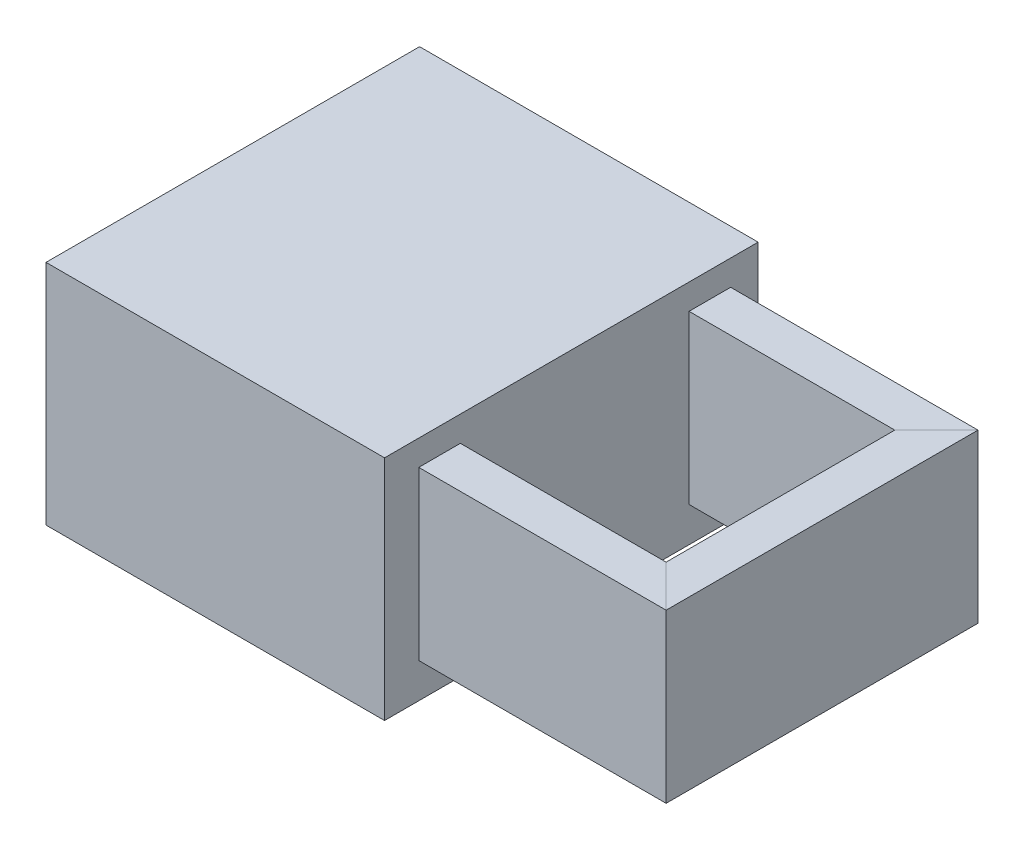
ISO-10303-21;
HEADER;
FILE_DESCRIPTION(('STEP AP214'),'2;1');
FILE_NAME('part.step','',(''),(''),'','','');
FILE_SCHEMA(('AUTOMOTIVE_DESIGN { 1 0 10303 214 1 1 1 1 }'));
ENDSEC;
DATA;
#1=APPLICATION_CONTEXT('core data for automotive mechanical design processes');
#2=APPLICATION_PROTOCOL_DEFINITION('international standard','automotive_design',2000,#1);
#3=PRODUCT_CONTEXT('',#1,'mechanical');
#4=PRODUCT('Part','Part','',(#3));
#5=PRODUCT_RELATED_PRODUCT_CATEGORY('part','',(#4));
#6=PRODUCT_DEFINITION_FORMATION('','',#4);
#7=PRODUCT_DEFINITION_CONTEXT('part definition',#1,'design');
#8=PRODUCT_DEFINITION('design','',#6,#7);
#9=PRODUCT_DEFINITION_SHAPE('','',#8);
#10=(LENGTH_UNIT() NAMED_UNIT(*) SI_UNIT(.MILLI.,.METRE.));
#11=(NAMED_UNIT(*) PLANE_ANGLE_UNIT() SI_UNIT($,.RADIAN.));
#12=(NAMED_UNIT(*) SI_UNIT($,.STERADIAN.) SOLID_ANGLE_UNIT());
#13=UNCERTAINTY_MEASURE_WITH_UNIT(LENGTH_MEASURE(1.E-05),#10,'distance_accuracy_value','');
#14=(GEOMETRIC_REPRESENTATION_CONTEXT(3) GLOBAL_UNCERTAINTY_ASSIGNED_CONTEXT((#13)) GLOBAL_UNIT_ASSIGNED_CONTEXT((#10,
#11,#12)) REPRESENTATION_CONTEXT('',''));
#15=CARTESIAN_POINT('',(0.,0.,0.));
#16=DIRECTION('',(0.,0.,1.));
#17=DIRECTION('',(1.,0.,0.));
#18=AXIS2_PLACEMENT_3D('',#15,#16,#17);
#19=CARTESIAN_POINT('',(35.0671663784504,-3.97466672374522,90.));
#20=DIRECTION('',(1.,0.,0.));
#21=DIRECTION('',(0.,0.,-1.));
#22=AXIS2_PLACEMENT_3D('',#19,#20,#21);
#23=PLANE('',#22);
#24=DIRECTION('',(0.,-1.,0.));
#25=VECTOR('',#24,1.);
#26=CARTESIAN_POINT('',(35.0671663784504,-10.0879019275339,81.7561807456855));
#27=LINE('',#26,#25);
#28=CARTESIAN_POINT('',(35.0671663784504,-10.0879019275339,81.7561807456855));
#29=VERTEX_POINT('',#28);
#30=CARTESIAN_POINT('',(35.0671663784504,-50.3889408943223,81.7561807456855));
#31=VERTEX_POINT('',#30);
#32=EDGE_CURVE('E58',#29,#31,#27,.T.);
#33=ORIENTED_EDGE('',*,*,#32,.F.);
#34=DIRECTION('',(0.,0.,1.));
#35=VECTOR('',#34,1.);
#36=CARTESIAN_POINT('',(35.0671663784504,-10.0879019275339,81.7561807456855));
#37=LINE('',#36,#35);
#38=CARTESIAN_POINT('',(35.0671663784504,-10.0879019275339,71.7363874347257));
#39=VERTEX_POINT('',#38);
#40=EDGE_CURVE('E126',#39,#29,#37,.T.);
#41=ORIENTED_EDGE('',*,*,#40,.F.);
#42=DIRECTION('',(0.,1.,0.));
#43=VECTOR('',#42,1.);
#44=CARTESIAN_POINT('',(35.0671663784504,-10.0879019275339,71.7363874347257));
#45=LINE('',#44,#43);
#46=CARTESIAN_POINT('',(35.0671663784504,-50.3889408943223,71.7363874347257));
#47=VERTEX_POINT('',#46);
#48=EDGE_CURVE('E122',#47,#39,#45,.T.);
#49=ORIENTED_EDGE('',*,*,#48,.F.);
#50=DIRECTION('',(0.,0.,-1.));
#51=VECTOR('',#50,1.);
#52=CARTESIAN_POINT('',(35.0671663784504,-50.3889408943223,81.7561807456855));
#53=LINE('',#52,#51);
#54=EDGE_CURVE('E125',#31,#47,#53,.T.);
#55=ORIENTED_EDGE('',*,*,#54,.F.);
#56=EDGE_LOOP('',(#33,#41,#49,#55));
#57=FACE_BOUND('',#56,.T.);
#58=DIRECTION('',(0.,-1.,0.));
#59=VECTOR('',#58,1.);
#60=CARTESIAN_POINT('',(35.0671663784504,-3.97466672374522,0.));
#61=LINE('',#60,#59);
#62=CARTESIAN_POINT('',(35.0671663784504,-3.97466672374522,0.));
#63=VERTEX_POINT('',#62);
#64=CARTESIAN_POINT('',(35.0671663784504,-58.7915357410409,0.));
#65=VERTEX_POINT('',#64);
#66=EDGE_CURVE('E222',#63,#65,#61,.T.);
#67=ORIENTED_EDGE('',*,*,#66,.F.);
#68=DIRECTION('',(0.,0.,-1.));
#69=VECTOR('',#68,1.);
#70=CARTESIAN_POINT('',(35.0671663784504,-3.97466672374522,90.));
#71=LINE('',#70,#69);
#72=CARTESIAN_POINT('',(35.0671663784504,-3.97466672374522,90.));
#73=VERTEX_POINT('',#72);
#74=EDGE_CURVE('E228',#73,#63,#71,.T.);
#75=ORIENTED_EDGE('',*,*,#74,.F.);
#76=DIRECTION('',(0.,-1.,0.));
#77=VECTOR('',#76,1.);
#78=CARTESIAN_POINT('',(35.0671663784504,-3.97466672374522,90.));
#79=LINE('',#78,#77);
#80=CARTESIAN_POINT('',(35.0671663784504,-58.7915357410409,90.));
#81=VERTEX_POINT('',#80);
#82=EDGE_CURVE('E208',#73,#81,#79,.T.);
#83=ORIENTED_EDGE('',*,*,#82,.T.);
#84=DIRECTION('',(0.,0.,-1.));
#85=VECTOR('',#84,1.);
#86=CARTESIAN_POINT('',(35.0671663784504,-58.7915357410409,90.));
#87=LINE('',#86,#85);
#88=EDGE_CURVE('E43',#81,#65,#87,.T.);
#89=ORIENTED_EDGE('',*,*,#88,.T.);
#90=EDGE_LOOP('',(#67,#75,#83,#89));
#91=FACE_BOUND('',#90,.T.);
#92=DIRECTION('',(0.,0.,-1.));
#93=VECTOR('',#92,1.);
#94=CARTESIAN_POINT('',(35.0671663784504,-10.0879019275339,6.622180574567));
#95=LINE('',#94,#93);
#96=CARTESIAN_POINT('',(35.0671663784504,-10.0879019275339,16.6419738855268));
#97=VERTEX_POINT('',#96);
#98=CARTESIAN_POINT('',(35.0671663784504,-10.0879019275339,6.622180574567));
#99=VERTEX_POINT('',#98);
#100=EDGE_CURVE('E180',#97,#99,#95,.T.);
#101=ORIENTED_EDGE('',*,*,#100,.T.);
#102=DIRECTION('',(0.,-1.,0.));
#103=VECTOR('',#102,1.);
#104=CARTESIAN_POINT('',(35.0671663784504,-10.0879019275339,6.622180574567));
#105=LINE('',#104,#103);
#106=CARTESIAN_POINT('',(35.0671663784504,-50.3889408943223,6.622180574567));
#107=VERTEX_POINT('',#106);
#108=EDGE_CURVE('E189',#99,#107,#105,.T.);
#109=ORIENTED_EDGE('',*,*,#108,.T.);
#110=DIRECTION('',(0.,0.,1.));
#111=VECTOR('',#110,1.);
#112=CARTESIAN_POINT('',(35.0671663784504,-50.3889408943223,6.622180574567));
#113=LINE('',#112,#111);
#114=CARTESIAN_POINT('',(35.0671663784504,-50.3889408943223,16.6419738855268));
#115=VERTEX_POINT('',#114);
#116=EDGE_CURVE('E186',#107,#115,#113,.T.);
#117=ORIENTED_EDGE('',*,*,#116,.T.);
#118=DIRECTION('',(0.,1.,0.));
#119=VECTOR('',#118,1.);
#120=CARTESIAN_POINT('',(35.0671663784504,-10.0879019275339,16.6419738855268));
#121=LINE('',#120,#119);
#122=EDGE_CURVE('E183',#115,#97,#121,.T.);
#123=ORIENTED_EDGE('',*,*,#122,.T.);
#124=EDGE_LOOP('',(#101,#109,#117,#123));
#125=FACE_BOUND('',#124,.T.);
#126=ADVANCED_FACE('F35',(#57,#91,#125),#23,.T.);
#127=CARTESIAN_POINT('',(-46.4942650313667,-3.97466672374522,90.));
#128=DIRECTION('',(1.,0.,0.));
#129=DIRECTION('',(0.,0.,-1.));
#130=AXIS2_PLACEMENT_3D('',#127,#128,#129);
#131=PLANE('',#130);
#132=DIRECTION('',(0.,-1.,0.));
#133=VECTOR('',#132,1.);
#134=CARTESIAN_POINT('',(-46.4942650313667,-3.97466672374522,0.));
#135=LINE('',#134,#133);
#136=CARTESIAN_POINT('',(-46.4942650313667,-3.97466672374522,0.));
#137=VERTEX_POINT('',#136);
#138=CARTESIAN_POINT('',(-46.4942650313667,-58.7915357410409,0.));
#139=VERTEX_POINT('',#138);
#140=EDGE_CURVE('E215',#137,#139,#135,.T.);
#141=ORIENTED_EDGE('',*,*,#140,.T.);
#142=DIRECTION('',(0.,0.,-1.));
#143=VECTOR('',#142,1.);
#144=CARTESIAN_POINT('',(-46.4942650313667,-58.7915357410409,90.));
#145=LINE('',#144,#143);
#146=CARTESIAN_POINT('',(-46.4942650313667,-58.7915357410409,90.));
#147=VERTEX_POINT('',#146);
#148=EDGE_CURVE('E11',#147,#139,#145,.T.);
#149=ORIENTED_EDGE('',*,*,#148,.F.);
#150=DIRECTION('',(0.,-1.,0.));
#151=VECTOR('',#150,1.);
#152=CARTESIAN_POINT('',(-46.4942650313667,-3.97466672374522,90.));
#153=LINE('',#152,#151);
#154=CARTESIAN_POINT('',(-46.4942650313667,-3.97466672374522,90.));
#155=VERTEX_POINT('',#154);
#156=EDGE_CURVE('E202',#155,#147,#153,.T.);
#157=ORIENTED_EDGE('',*,*,#156,.F.);
#158=DIRECTION('',(0.,0.,-1.));
#159=VECTOR('',#158,1.);
#160=CARTESIAN_POINT('',(-46.4942650313667,-3.97466672374522,90.));
#161=LINE('',#160,#159);
#162=EDGE_CURVE('E214',#155,#137,#161,.T.);
#163=ORIENTED_EDGE('',*,*,#162,.T.);
#164=EDGE_LOOP('',(#141,#149,#157,#163));
#165=FACE_BOUND('',#164,.T.);
#166=ADVANCED_FACE('F37',(#165),#131,.F.);
#167=CARTESIAN_POINT('',(-46.4942650313667,-58.7915357410409,90.));
#168=DIRECTION('',(0.,1.,0.));
#169=DIRECTION('',(0.,0.,1.));
#170=AXIS2_PLACEMENT_3D('',#167,#168,#169);
#171=PLANE('',#170);
#172=DIRECTION('',(1.,0.,0.));
#173=VECTOR('',#172,1.);
#174=CARTESIAN_POINT('',(-46.4942650313667,-58.7915357410409,0.));
#175=LINE('',#174,#173);
#176=EDGE_CURVE('E218',#139,#65,#175,.T.);
#177=ORIENTED_EDGE('',*,*,#176,.T.);
#178=ORIENTED_EDGE('',*,*,#88,.F.);
#179=DIRECTION('',(1.,0.,0.));
#180=VECTOR('',#179,1.);
#181=CARTESIAN_POINT('',(-46.4942650313667,-58.7915357410409,90.));
#182=LINE('',#181,#180);
#183=EDGE_CURVE('E205',#147,#81,#182,.T.);
#184=ORIENTED_EDGE('',*,*,#183,.F.);
#185=ORIENTED_EDGE('',*,*,#148,.T.);
#186=EDGE_LOOP('',(#177,#178,#184,#185));
#187=FACE_BOUND('',#186,.T.);
#188=ADVANCED_FACE('F234',(#187),#171,.F.);
#189=CARTESIAN_POINT('',(-46.4942650313667,-3.97466672374522,90.));
#190=DIRECTION('',(0.,1.,0.));
#191=DIRECTION('',(0.,0.,1.));
#192=AXIS2_PLACEMENT_3D('',#189,#190,#191);
#193=PLANE('',#192);
#194=DIRECTION('',(1.,0.,0.));
#195=VECTOR('',#194,1.);
#196=CARTESIAN_POINT('',(-46.4942650313667,-3.97466672374522,0.));
#197=LINE('',#196,#195);
#198=EDGE_CURVE('E206',#137,#63,#197,.T.);
#199=ORIENTED_EDGE('',*,*,#198,.F.);
#200=ORIENTED_EDGE('',*,*,#162,.F.);
#201=DIRECTION('',(1.,0.,0.));
#202=VECTOR('',#201,1.);
#203=CARTESIAN_POINT('',(-46.4942650313667,-3.97466672374522,90.));
#204=LINE('',#203,#202);
#205=EDGE_CURVE('E211',#155,#73,#204,.T.);
#206=ORIENTED_EDGE('',*,*,#205,.T.);
#207=ORIENTED_EDGE('',*,*,#74,.T.);
#208=EDGE_LOOP('',(#199,#200,#206,#207));
#209=FACE_BOUND('',#208,.T.);
#210=ADVANCED_FACE('F241',(#209),#193,.T.);
#211=CARTESIAN_POINT('',(0.,0.,90.));
#212=DIRECTION('',(0.,0.,1.));
#213=DIRECTION('',(1.,0.,0.));
#214=AXIS2_PLACEMENT_3D('',#211,#212,#213);
#215=PLANE('',#214);
#216=ORIENTED_EDGE('',*,*,#156,.T.);
#217=ORIENTED_EDGE('',*,*,#183,.T.);
#218=ORIENTED_EDGE('',*,*,#82,.F.);
#219=ORIENTED_EDGE('',*,*,#205,.F.);
#220=EDGE_LOOP('',(#216,#217,#218,#219));
#221=FACE_BOUND('',#220,.T.);
#222=ADVANCED_FACE('F245',(#221),#215,.T.);
#223=CARTESIAN_POINT('',(0.,0.,0.));
#224=DIRECTION('',(0.,0.,1.));
#225=DIRECTION('',(1.,0.,0.));
#226=AXIS2_PLACEMENT_3D('',#223,#224,#225);
#227=PLANE('',#226);
#228=ORIENTED_EDGE('',*,*,#140,.F.);
#229=ORIENTED_EDGE('',*,*,#198,.T.);
#230=ORIENTED_EDGE('',*,*,#66,.T.);
#231=ORIENTED_EDGE('',*,*,#176,.F.);
#232=EDGE_LOOP('',(#228,#229,#230,#231));
#233=FACE_BOUND('',#232,.T.);
#234=ADVANCED_FACE('F238',(#233),#227,.F.);
#235=CARTESIAN_POINT('',(95.2588675173923,-10.0879019275339,6.622180574567));
#236=DIRECTION('',(0.,0.,-1.));
#237=DIRECTION('',(-1.,0.,0.));
#238=AXIS2_PLACEMENT_3D('',#235,#236,#237);
#239=PLANE('',#238);
#240=DIRECTION('',(0.,1.,0.));
#241=VECTOR('',#240,1.);
#242=CARTESIAN_POINT('',(94.6578778518443,-10.0879019275339,6.622180574567));
#243=LINE('',#242,#241);
#244=CARTESIAN_POINT('',(94.6578778518443,-50.3889408943223,6.622180574567));
#245=VERTEX_POINT('',#244);
#246=CARTESIAN_POINT('',(94.6578778518443,-10.0879019275339,6.622180574567));
#247=VERTEX_POINT('',#246);
#248=EDGE_CURVE('E165',#245,#247,#243,.T.);
#249=ORIENTED_EDGE('',*,*,#248,.F.);
#250=DIRECTION('',(-1.,0.,0.));
#251=VECTOR('',#250,1.);
#252=CARTESIAN_POINT('',(95.2588675173923,-50.3889408943223,6.622180574567));
#253=LINE('',#252,#251);
#254=EDGE_CURVE('E198',#245,#107,#253,.T.);
#255=ORIENTED_EDGE('',*,*,#254,.T.);
#256=ORIENTED_EDGE('',*,*,#108,.F.);
#257=DIRECTION('',(-1.,0.,0.));
#258=VECTOR('',#257,1.);
#259=CARTESIAN_POINT('',(95.2588675173923,-10.0879019275339,6.622180574567));
#260=LINE('',#259,#258);
#261=EDGE_CURVE('E50',#247,#99,#260,.T.);
#262=ORIENTED_EDGE('',*,*,#261,.F.);
#263=EDGE_LOOP('',(#249,#255,#256,#262));
#264=FACE_BOUND('',#263,.T.);
#265=ADVANCED_FACE('F260',(#264),#239,.T.);
#266=CARTESIAN_POINT('',(95.2588675173923,-50.3889408943223,6.622180574567));
#267=DIRECTION('',(0.,-1.,0.));
#268=DIRECTION('',(0.,0.,-1.));
#269=AXIS2_PLACEMENT_3D('',#266,#267,#268);
#270=PLANE('',#269);
#271=DIRECTION('',(0.707106781186548,0.,-0.707106781186548));
#272=VECTOR('',#271,1.);
#273=CARTESIAN_POINT('',(56.7903829335111,-50.3889408943223,44.4896754929002));
#274=LINE('',#273,#272);
#275=CARTESIAN_POINT('',(84.6380845408845,-50.3889408943223,16.6419738855268));
#276=VERTEX_POINT('',#275);
#277=EDGE_CURVE('E156',#276,#245,#274,.T.);
#278=ORIENTED_EDGE('',*,*,#277,.F.);
#279=DIRECTION('',(-1.,0.,0.));
#280=VECTOR('',#279,1.);
#281=CARTESIAN_POINT('',(95.2588675173923,-50.3889408943223,16.6419738855268));
#282=LINE('',#281,#280);
#283=EDGE_CURVE('E195',#276,#115,#282,.T.);
#284=ORIENTED_EDGE('',*,*,#283,.T.);
#285=ORIENTED_EDGE('',*,*,#116,.F.);
#286=ORIENTED_EDGE('',*,*,#254,.F.);
#287=EDGE_LOOP('',(#278,#284,#285,#286));
#288=FACE_BOUND('',#287,.T.);
#289=ADVANCED_FACE('F271',(#288),#270,.T.);
#290=CARTESIAN_POINT('',(95.2588675173923,-10.0879019275339,16.6419738855268));
#291=DIRECTION('',(0.,0.,1.));
#292=DIRECTION('',(1.,0.,0.));
#293=AXIS2_PLACEMENT_3D('',#290,#291,#292);
#294=PLANE('',#293);
#295=DIRECTION('',(0.,-1.,0.));
#296=VECTOR('',#295,1.);
#297=CARTESIAN_POINT('',(84.6380845408845,-10.0879019275339,16.6419738855268));
#298=LINE('',#297,#296);
#299=CARTESIAN_POINT('',(84.6380845408845,-10.0879019275339,16.6419738855268));
#300=VERTEX_POINT('',#299);
#301=EDGE_CURVE('E159',#300,#276,#298,.T.);
#302=ORIENTED_EDGE('',*,*,#301,.F.);
#303=DIRECTION('',(-1.,0.,0.));
#304=VECTOR('',#303,1.);
#305=CARTESIAN_POINT('',(95.2588675173923,-10.0879019275339,16.6419738855268));
#306=LINE('',#305,#304);
#307=EDGE_CURVE('E192',#300,#97,#306,.T.);
#308=ORIENTED_EDGE('',*,*,#307,.T.);
#309=ORIENTED_EDGE('',*,*,#122,.F.);
#310=ORIENTED_EDGE('',*,*,#283,.F.);
#311=EDGE_LOOP('',(#302,#308,#309,#310));
#312=FACE_BOUND('',#311,.T.);
#313=ADVANCED_FACE('F268',(#312),#294,.T.);
#314=CARTESIAN_POINT('',(95.2588675173923,-10.0879019275339,6.622180574567));
#315=DIRECTION('',(0.,1.,0.));
#316=DIRECTION('',(0.,0.,1.));
#317=AXIS2_PLACEMENT_3D('',#314,#315,#316);
#318=PLANE('',#317);
#319=DIRECTION('',(-0.707106781186548,0.,0.707106781186548));
#320=VECTOR('',#319,1.);
#321=CARTESIAN_POINT('',(56.7903829335111,-10.0879019275339,44.4896754929002));
#322=LINE('',#321,#320);
#323=EDGE_CURVE('E162',#247,#300,#322,.T.);
#324=ORIENTED_EDGE('',*,*,#323,.F.);
#325=ORIENTED_EDGE('',*,*,#261,.T.);
#326=ORIENTED_EDGE('',*,*,#100,.F.);
#327=ORIENTED_EDGE('',*,*,#307,.F.);
#328=EDGE_LOOP('',(#324,#325,#326,#327));
#329=FACE_BOUND('',#328,.T.);
#330=ADVANCED_FACE('F264',(#329),#318,.T.);
#331=CARTESIAN_POINT('',(94.6578778518443,-10.0879019275339,82.3571704112334));
#332=DIRECTION('',(0.,1.,0.));
#333=DIRECTION('',(0.,0.,1.));
#334=AXIS2_PLACEMENT_3D('',#331,#332,#333);
#335=PLANE('',#334);
#336=DIRECTION('',(0.,0.,-1.));
#337=VECTOR('',#336,1.);
#338=CARTESIAN_POINT('',(94.6578778518443,-10.0879019275339,82.3571704112334));
#339=LINE('',#338,#337);
#340=CARTESIAN_POINT('',(94.6578778518443,-10.0879019275339,81.7561807456855));
#341=VERTEX_POINT('',#340);
#342=EDGE_CURVE('E175',#341,#247,#339,.T.);
#343=ORIENTED_EDGE('',*,*,#342,.T.);
#344=ORIENTED_EDGE('',*,*,#323,.T.);
#345=DIRECTION('',(0.,0.,-1.));
#346=VECTOR('',#345,1.);
#347=CARTESIAN_POINT('',(84.6380845408845,-10.0879019275339,82.3571704112334));
#348=LINE('',#347,#346);
#349=CARTESIAN_POINT('',(84.6380845408845,-10.0879019275339,71.7363874347257));
#350=VERTEX_POINT('',#349);
#351=EDGE_CURVE('E166',#350,#300,#348,.T.);
#352=ORIENTED_EDGE('',*,*,#351,.F.);
#353=DIRECTION('',(-0.707106781186548,0.,-0.707106781186548));
#354=VECTOR('',#353,1.);
#355=CARTESIAN_POINT('',(64.8625221151473,-10.0879019275339,51.9608250089885));
#356=LINE('',#355,#354);
#357=EDGE_CURVE('E155',#341,#350,#356,.T.);
#358=ORIENTED_EDGE('',*,*,#357,.F.);
#359=EDGE_LOOP('',(#343,#344,#352,#358));
#360=FACE_BOUND('',#359,.T.);
#361=ADVANCED_FACE('F267',(#360),#335,.T.);
#362=CARTESIAN_POINT('',(84.6380845408845,-10.0879019275339,82.3571704112334));
#363=DIRECTION('',(-1.,0.,0.));
#364=DIRECTION('',(0.,0.,1.));
#365=AXIS2_PLACEMENT_3D('',#362,#363,#364);
#366=PLANE('',#365);
#367=ORIENTED_EDGE('',*,*,#351,.T.);
#368=ORIENTED_EDGE('',*,*,#301,.T.);
#369=DIRECTION('',(0.,0.,-1.));
#370=VECTOR('',#369,1.);
#371=CARTESIAN_POINT('',(84.6380845408845,-50.3889408943223,82.3571704112334));
#372=LINE('',#371,#370);
#373=CARTESIAN_POINT('',(84.6380845408845,-50.3889408943223,71.7363874347257));
#374=VERTEX_POINT('',#373);
#375=EDGE_CURVE('E169',#374,#276,#372,.T.);
#376=ORIENTED_EDGE('',*,*,#375,.F.);
#377=DIRECTION('',(0.,-1.,0.));
#378=VECTOR('',#377,1.);
#379=CARTESIAN_POINT('',(84.6380845408845,-10.0879019275339,71.7363874347257));
#380=LINE('',#379,#378);
#381=EDGE_CURVE('E143',#350,#374,#380,.T.);
#382=ORIENTED_EDGE('',*,*,#381,.F.);
#383=EDGE_LOOP('',(#367,#368,#376,#382));
#384=FACE_BOUND('',#383,.T.);
#385=ADVANCED_FACE('F281',(#384),#366,.T.);
#386=CARTESIAN_POINT('',(94.6578778518443,-50.3889408943223,82.3571704112334));
#387=DIRECTION('',(0.,-1.,0.));
#388=DIRECTION('',(0.,0.,-1.));
#389=AXIS2_PLACEMENT_3D('',#386,#387,#388);
#390=PLANE('',#389);
#391=ORIENTED_EDGE('',*,*,#375,.T.);
#392=ORIENTED_EDGE('',*,*,#277,.T.);
#393=DIRECTION('',(0.,0.,-1.));
#394=VECTOR('',#393,1.);
#395=CARTESIAN_POINT('',(94.6578778518443,-50.3889408943223,82.3571704112334));
#396=LINE('',#395,#394);
#397=CARTESIAN_POINT('',(94.6578778518443,-50.3889408943223,81.7561807456855));
#398=VERTEX_POINT('',#397);
#399=EDGE_CURVE('E172',#398,#245,#396,.T.);
#400=ORIENTED_EDGE('',*,*,#399,.F.);
#401=DIRECTION('',(0.707106781186548,0.,0.707106781186548));
#402=VECTOR('',#401,1.);
#403=CARTESIAN_POINT('',(64.8625221151473,-50.3889408943223,51.9608250089885));
#404=LINE('',#403,#402);
#405=EDGE_CURVE('E219',#374,#398,#404,.T.);
#406=ORIENTED_EDGE('',*,*,#405,.F.);
#407=EDGE_LOOP('',(#391,#392,#400,#406));
#408=FACE_BOUND('',#407,.T.);
#409=ADVANCED_FACE('F285',(#408),#390,.T.);
#410=CARTESIAN_POINT('',(94.6578778518443,-10.0879019275339,82.3571704112334));
#411=DIRECTION('',(1.,0.,0.));
#412=DIRECTION('',(0.,0.,-1.));
#413=AXIS2_PLACEMENT_3D('',#410,#411,#412);
#414=PLANE('',#413);
#415=ORIENTED_EDGE('',*,*,#399,.T.);
#416=ORIENTED_EDGE('',*,*,#248,.T.);
#417=ORIENTED_EDGE('',*,*,#342,.F.);
#418=DIRECTION('',(0.,1.,0.));
#419=VECTOR('',#418,1.);
#420=CARTESIAN_POINT('',(94.6578778518443,-10.0879019275339,81.7561807456855));
#421=LINE('',#420,#419);
#422=EDGE_CURVE('E146',#398,#341,#421,.T.);
#423=ORIENTED_EDGE('',*,*,#422,.F.);
#424=EDGE_LOOP('',(#415,#416,#417,#423));
#425=FACE_BOUND('',#424,.T.);
#426=ADVANCED_FACE('F289',(#425),#414,.T.);
#427=CARTESIAN_POINT('',(35.0671663784504,-10.0879019275339,81.7561807456855));
#428=DIRECTION('',(0.,1.,0.));
#429=DIRECTION('',(0.,0.,1.));
#430=AXIS2_PLACEMENT_3D('',#427,#428,#429);
#431=PLANE('',#430);
#432=DIRECTION('',(1.,0.,0.));
#433=VECTOR('',#432,1.);
#434=CARTESIAN_POINT('',(35.0671663784504,-10.0879019275339,81.7561807456855));
#435=LINE('',#434,#433);
#436=EDGE_CURVE('E148',#29,#341,#435,.T.);
#437=ORIENTED_EDGE('',*,*,#436,.T.);
#438=ORIENTED_EDGE('',*,*,#357,.T.);
#439=DIRECTION('',(1.,0.,0.));
#440=VECTOR('',#439,1.);
#441=CARTESIAN_POINT('',(35.0671663784504,-10.0879019275339,71.7363874347257));
#442=LINE('',#441,#440);
#443=EDGE_CURVE('E144',#39,#350,#442,.T.);
#444=ORIENTED_EDGE('',*,*,#443,.F.);
#445=ORIENTED_EDGE('',*,*,#40,.T.);
#446=EDGE_LOOP('',(#437,#438,#444,#445));
#447=FACE_BOUND('',#446,.T.);
#448=ADVANCED_FACE('F293',(#447),#431,.T.);
#449=CARTESIAN_POINT('',(35.0671663784504,-10.0879019275339,71.7363874347257));
#450=DIRECTION('',(0.,0.,-1.));
#451=DIRECTION('',(-1.,0.,0.));
#452=AXIS2_PLACEMENT_3D('',#449,#450,#451);
#453=PLANE('',#452);
#454=ORIENTED_EDGE('',*,*,#443,.T.);
#455=ORIENTED_EDGE('',*,*,#381,.T.);
#456=DIRECTION('',(1.,0.,0.));
#457=VECTOR('',#456,1.);
#458=CARTESIAN_POINT('',(35.0671663784504,-50.3889408943223,71.7363874347257));
#459=LINE('',#458,#457);
#460=EDGE_CURVE('E137',#47,#374,#459,.T.);
#461=ORIENTED_EDGE('',*,*,#460,.F.);
#462=ORIENTED_EDGE('',*,*,#48,.T.);
#463=EDGE_LOOP('',(#454,#455,#461,#462));
#464=FACE_BOUND('',#463,.T.);
#465=ADVANCED_FACE('F142',(#464),#453,.T.);
#466=CARTESIAN_POINT('',(35.0671663784504,-50.3889408943223,81.7561807456855));
#467=DIRECTION('',(0.,-1.,0.));
#468=DIRECTION('',(0.,0.,-1.));
#469=AXIS2_PLACEMENT_3D('',#466,#467,#468);
#470=PLANE('',#469);
#471=ORIENTED_EDGE('',*,*,#460,.T.);
#472=ORIENTED_EDGE('',*,*,#405,.T.);
#473=DIRECTION('',(1.,0.,0.));
#474=VECTOR('',#473,1.);
#475=CARTESIAN_POINT('',(35.0671663784504,-50.3889408943223,81.7561807456855));
#476=LINE('',#475,#474);
#477=EDGE_CURVE('E139',#31,#398,#476,.T.);
#478=ORIENTED_EDGE('',*,*,#477,.F.);
#479=ORIENTED_EDGE('',*,*,#54,.T.);
#480=EDGE_LOOP('',(#471,#472,#478,#479));
#481=FACE_BOUND('',#480,.T.);
#482=ADVANCED_FACE('F135',(#481),#470,.T.);
#483=CARTESIAN_POINT('',(35.0671663784504,-10.0879019275339,81.7561807456855));
#484=DIRECTION('',(0.,0.,1.));
#485=DIRECTION('',(1.,0.,0.));
#486=AXIS2_PLACEMENT_3D('',#483,#484,#485);
#487=PLANE('',#486);
#488=ORIENTED_EDGE('',*,*,#477,.T.);
#489=ORIENTED_EDGE('',*,*,#422,.T.);
#490=ORIENTED_EDGE('',*,*,#436,.F.);
#491=ORIENTED_EDGE('',*,*,#32,.T.);
#492=EDGE_LOOP('',(#488,#489,#490,#491));
#493=FACE_BOUND('',#492,.T.);
#494=ADVANCED_FACE('F261',(#493),#487,.T.);
#495=CLOSED_SHELL('',(#126,#166,#188,#210,#222,#234,#265,#289,#313,#330,#361,#385,#409,#426,
#448,#465,#482,#494));
#496=MANIFOLD_SOLID_BREP('B2',#495);
#497=ADVANCED_BREP_SHAPE_REPRESENTATION('',(#18,#496),#14);
#498=SHAPE_DEFINITION_REPRESENTATION(#9,#497);
ENDSEC;
END-ISO-10303-21;
